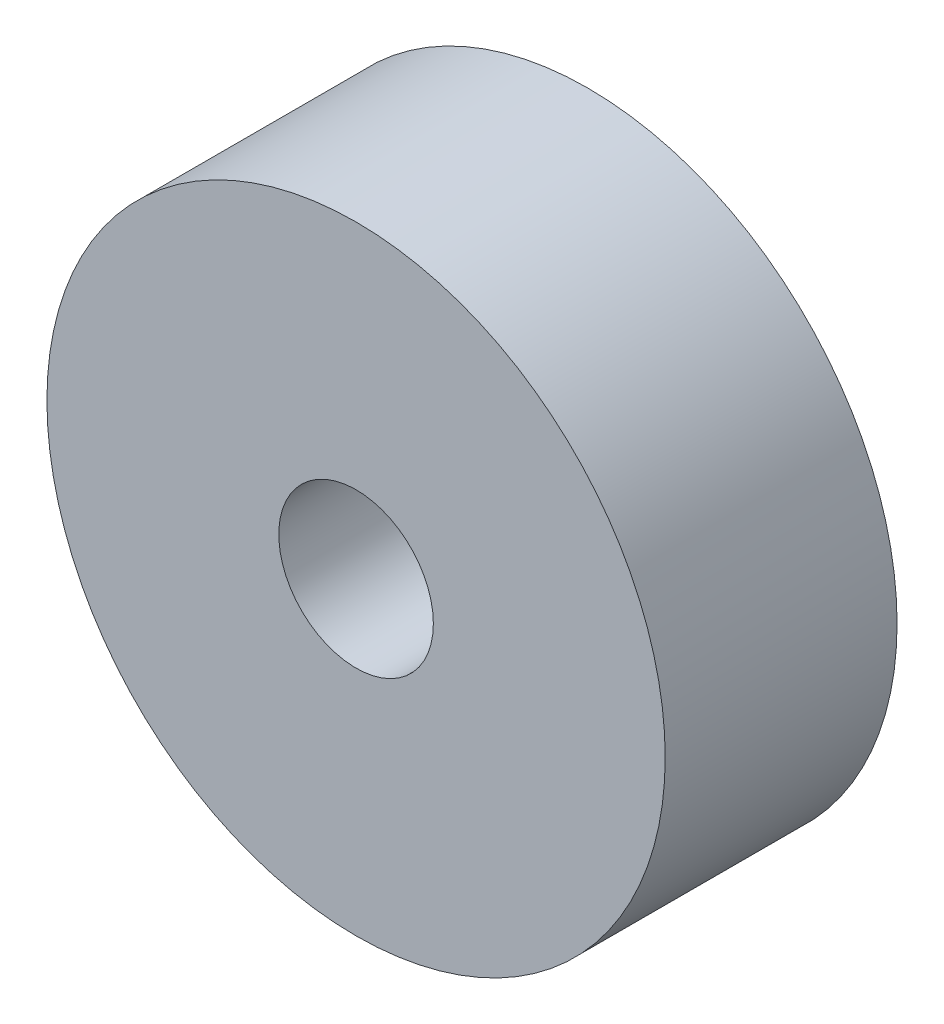
ISO-10303-21;
HEADER;
FILE_DESCRIPTION(('STEP AP214'),'2;1');
FILE_NAME('part.step','',(''),(''),'','','');
FILE_SCHEMA(('AUTOMOTIVE_DESIGN { 1 0 10303 214 1 1 1 1 }'));
ENDSEC;
DATA;
#1=APPLICATION_CONTEXT('core data for automotive mechanical design processes');
#2=APPLICATION_PROTOCOL_DEFINITION('international standard','automotive_design',2000,#1);
#3=PRODUCT_CONTEXT('',#1,'mechanical');
#4=PRODUCT('Part','Part','',(#3));
#5=PRODUCT_RELATED_PRODUCT_CATEGORY('part','',(#4));
#6=PRODUCT_DEFINITION_FORMATION('','',#4);
#7=PRODUCT_DEFINITION_CONTEXT('part definition',#1,'design');
#8=PRODUCT_DEFINITION('design','',#6,#7);
#9=PRODUCT_DEFINITION_SHAPE('','',#8);
#10=(LENGTH_UNIT() NAMED_UNIT(*) SI_UNIT(.MILLI.,.METRE.));
#11=(NAMED_UNIT(*) PLANE_ANGLE_UNIT() SI_UNIT($,.RADIAN.));
#12=(NAMED_UNIT(*) SI_UNIT($,.STERADIAN.) SOLID_ANGLE_UNIT());
#13=UNCERTAINTY_MEASURE_WITH_UNIT(LENGTH_MEASURE(1.E-05),#10,'distance_accuracy_value','');
#14=(GEOMETRIC_REPRESENTATION_CONTEXT(3) GLOBAL_UNCERTAINTY_ASSIGNED_CONTEXT((#13)) GLOBAL_UNIT_ASSIGNED_CONTEXT((#10,
#11,#12)) REPRESENTATION_CONTEXT('',''));
#15=CARTESIAN_POINT('',(0.,0.,0.));
#16=DIRECTION('',(0.,0.,1.));
#17=DIRECTION('',(1.,0.,0.));
#18=AXIS2_PLACEMENT_3D('',#15,#16,#17);
#19=CARTESIAN_POINT('',(0.,0.,6.));
#20=DIRECTION('',(0.,0.,1.));
#21=DIRECTION('',(1.,0.,0.));
#22=AXIS2_PLACEMENT_3D('',#19,#20,#21);
#23=PLANE('',#22);
#24=CARTESIAN_POINT('',(0.,0.,6.));
#25=DIRECTION('',(0.,0.,1.));
#26=DIRECTION('',(1.,0.,0.));
#27=AXIS2_PLACEMENT_3D('',#24,#25,#26);
#28=CIRCLE('',#27,8.);
#29=CARTESIAN_POINT('',(8.,0.,6.));
#30=VERTEX_POINT('',#29);
#31=EDGE_CURVE('E10',#30,#30,#28,.T.);
#32=ORIENTED_EDGE('',*,*,#31,.T.);
#33=EDGE_LOOP('',(#32));
#34=FACE_BOUND('',#33,.T.);
#35=CARTESIAN_POINT('',(0.,0.,6.));
#36=DIRECTION('',(0.,0.,1.));
#37=DIRECTION('',(1.,0.,0.));
#38=AXIS2_PLACEMENT_3D('',#35,#36,#37);
#39=CIRCLE('',#38,2.);
#40=CARTESIAN_POINT('',(2.,0.,6.));
#41=VERTEX_POINT('',#40);
#42=EDGE_CURVE('E50',#41,#41,#39,.T.);
#43=ORIENTED_EDGE('',*,*,#42,.F.);
#44=EDGE_LOOP('',(#43));
#45=FACE_BOUND('',#44,.T.);
#46=ADVANCED_FACE('F37',(#34,#45),#23,.T.);
#47=CARTESIAN_POINT('',(0.,0.,0.));
#48=DIRECTION('',(0.,0.,1.));
#49=DIRECTION('',(1.,0.,0.));
#50=AXIS2_PLACEMENT_3D('',#47,#48,#49);
#51=PLANE('',#50);
#52=CARTESIAN_POINT('',(0.,0.,0.));
#53=DIRECTION('',(0.,0.,1.));
#54=DIRECTION('',(1.,0.,0.));
#55=AXIS2_PLACEMENT_3D('',#52,#53,#54);
#56=CIRCLE('',#55,8.);
#57=CARTESIAN_POINT('',(8.,0.,0.));
#58=VERTEX_POINT('',#57);
#59=EDGE_CURVE('E41',#58,#58,#56,.T.);
#60=ORIENTED_EDGE('',*,*,#59,.F.);
#61=EDGE_LOOP('',(#60));
#62=FACE_BOUND('',#61,.T.);
#63=CARTESIAN_POINT('',(0.,0.,0.));
#64=DIRECTION('',(0.,0.,1.));
#65=DIRECTION('',(1.,0.,0.));
#66=AXIS2_PLACEMENT_3D('',#63,#64,#65);
#67=CIRCLE('',#66,2.);
#68=CARTESIAN_POINT('',(2.,0.,0.));
#69=VERTEX_POINT('',#68);
#70=EDGE_CURVE('E52',#69,#69,#67,.T.);
#71=ORIENTED_EDGE('',*,*,#70,.T.);
#72=EDGE_LOOP('',(#71));
#73=FACE_BOUND('',#72,.T.);
#74=ADVANCED_FACE('F64',(#62,#73),#51,.F.);
#75=CARTESIAN_POINT('',(0.,0.,6.));
#76=DIRECTION('',(0.,0.,-1.));
#77=DIRECTION('',(-1.,0.,0.));
#78=AXIS2_PLACEMENT_3D('',#75,#76,#77);
#79=CYLINDRICAL_SURFACE('',#78,8.);
#80=ORIENTED_EDGE('',*,*,#31,.F.);
#81=EDGE_LOOP('',(#80));
#82=FACE_BOUND('',#81,.T.);
#83=ORIENTED_EDGE('',*,*,#59,.T.);
#84=EDGE_LOOP('',(#83));
#85=FACE_BOUND('',#84,.T.);
#86=ADVANCED_FACE('F39',(#82,#85),#79,.T.);
#87=CARTESIAN_POINT('',(0.,0.,6.));
#88=DIRECTION('',(0.,0.,-1.));
#89=DIRECTION('',(-1.,0.,0.));
#90=AXIS2_PLACEMENT_3D('',#87,#88,#89);
#91=CYLINDRICAL_SURFACE('',#90,2.);
#92=ORIENTED_EDGE('',*,*,#42,.T.);
#93=EDGE_LOOP('',(#92));
#94=FACE_BOUND('',#93,.T.);
#95=ORIENTED_EDGE('',*,*,#70,.F.);
#96=EDGE_LOOP('',(#95));
#97=FACE_BOUND('',#96,.T.);
#98=ADVANCED_FACE('F60',(#94,#97),#91,.F.);
#99=CLOSED_SHELL('',(#46,#74,#86,#98));
#100=MANIFOLD_SOLID_BREP('B2',#99);
#101=ADVANCED_BREP_SHAPE_REPRESENTATION('',(#18,#100),#14);
#102=SHAPE_DEFINITION_REPRESENTATION(#9,#101);
ENDSEC;
END-ISO-10303-21;
